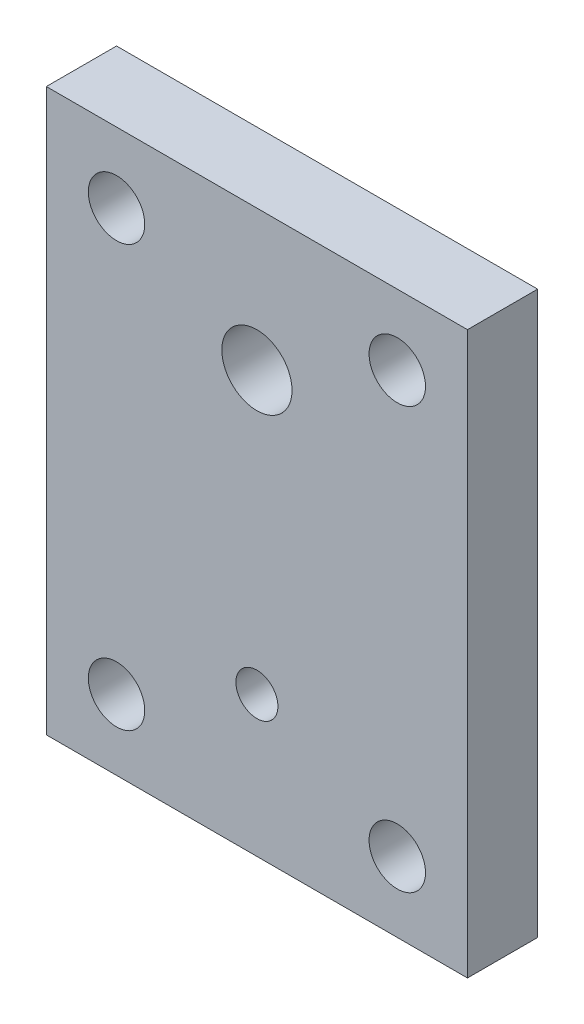
ISO-10303-21;
HEADER;
FILE_DESCRIPTION(('STEP AP214'),'2;1');
FILE_NAME('part.step','',(''),(''),'','','');
FILE_SCHEMA(('AUTOMOTIVE_DESIGN { 1 0 10303 214 1 1 1 1 }'));
ENDSEC;
DATA;
#1=APPLICATION_CONTEXT('core data for automotive mechanical design processes');
#2=APPLICATION_PROTOCOL_DEFINITION('international standard','automotive_design',2000,#1);
#3=PRODUCT_CONTEXT('',#1,'mechanical');
#4=PRODUCT('Part','Part','',(#3));
#5=PRODUCT_RELATED_PRODUCT_CATEGORY('part','',(#4));
#6=PRODUCT_DEFINITION_FORMATION('','',#4);
#7=PRODUCT_DEFINITION_CONTEXT('part definition',#1,'design');
#8=PRODUCT_DEFINITION('design','',#6,#7);
#9=PRODUCT_DEFINITION_SHAPE('','',#8);
#10=(LENGTH_UNIT() NAMED_UNIT(*) SI_UNIT(.MILLI.,.METRE.));
#11=(NAMED_UNIT(*) PLANE_ANGLE_UNIT() SI_UNIT($,.RADIAN.));
#12=(NAMED_UNIT(*) SI_UNIT($,.STERADIAN.) SOLID_ANGLE_UNIT());
#13=UNCERTAINTY_MEASURE_WITH_UNIT(LENGTH_MEASURE(1.E-05),#10,'distance_accuracy_value','');
#14=(GEOMETRIC_REPRESENTATION_CONTEXT(3) GLOBAL_UNCERTAINTY_ASSIGNED_CONTEXT((#13)) GLOBAL_UNIT_ASSIGNED_CONTEXT((#10,
#11,#12)) REPRESENTATION_CONTEXT('',''));
#15=CARTESIAN_POINT('',(0.,0.,0.));
#16=DIRECTION('',(0.,0.,1.));
#17=DIRECTION('',(1.,0.,0.));
#18=AXIS2_PLACEMENT_3D('',#15,#16,#17);
#19=CARTESIAN_POINT('',(0.,0.,6.35));
#20=DIRECTION('',(0.,0.,-1.));
#21=DIRECTION('',(-1.,0.,0.));
#22=AXIS2_PLACEMENT_3D('',#19,#20,#21);
#23=PLANE('',#22);
#24=DIRECTION('',(0.,-1.,0.));
#25=VECTOR('',#24,1.);
#26=CARTESIAN_POINT('',(0.,0.,6.35));
#27=LINE('',#26,#25);
#28=CARTESIAN_POINT('',(0.,50.8,6.35));
#29=VERTEX_POINT('',#28);
#30=CARTESIAN_POINT('',(0.,0.,6.35));
#31=VERTEX_POINT('',#30);
#32=EDGE_CURVE('E84',#29,#31,#27,.T.);
#33=ORIENTED_EDGE('',*,*,#32,.T.);
#34=DIRECTION('',(1.,0.,0.));
#35=VECTOR('',#34,1.);
#36=CARTESIAN_POINT('',(0.,0.,6.35));
#37=LINE('',#36,#35);
#38=CARTESIAN_POINT('',(38.1,0.,6.35));
#39=VERTEX_POINT('',#38);
#40=EDGE_CURVE('E79',#31,#39,#37,.T.);
#41=ORIENTED_EDGE('',*,*,#40,.T.);
#42=DIRECTION('',(0.,1.,0.));
#43=VECTOR('',#42,1.);
#44=CARTESIAN_POINT('',(38.1,0.,6.35));
#45=LINE('',#44,#43);
#46=CARTESIAN_POINT('',(38.1,50.8,6.35));
#47=VERTEX_POINT('',#46);
#48=EDGE_CURVE('E82',#39,#47,#45,.T.);
#49=ORIENTED_EDGE('',*,*,#48,.T.);
#50=DIRECTION('',(-1.,0.,0.));
#51=VECTOR('',#50,1.);
#52=CARTESIAN_POINT('',(0.,50.8,6.35));
#53=LINE('',#52,#51);
#54=EDGE_CURVE('E49',#47,#29,#53,.T.);
#55=ORIENTED_EDGE('',*,*,#54,.T.);
#56=EDGE_LOOP('',(#33,#41,#49,#55));
#57=FACE_BOUND('',#56,.T.);
#58=CARTESIAN_POINT('',(6.35,44.45,6.35));
#59=DIRECTION('',(0.,0.,1.));
#60=DIRECTION('',(1.,0.,0.));
#61=AXIS2_PLACEMENT_3D('',#58,#59,#60);
#62=CIRCLE('',#61,2.5527);
#63=CARTESIAN_POINT('',(8.9027,44.45,6.35));
#64=VERTEX_POINT('',#63);
#65=EDGE_CURVE('E99',#64,#64,#62,.T.);
#66=ORIENTED_EDGE('',*,*,#65,.F.);
#67=EDGE_LOOP('',(#66));
#68=FACE_BOUND('',#67,.T.);
#69=CARTESIAN_POINT('',(31.75,44.45,6.35));
#70=DIRECTION('',(0.,0.,1.));
#71=DIRECTION('',(1.,0.,0.));
#72=AXIS2_PLACEMENT_3D('',#69,#70,#71);
#73=CIRCLE('',#72,2.5527);
#74=CARTESIAN_POINT('',(34.3027,44.45,6.35));
#75=VERTEX_POINT('',#74);
#76=EDGE_CURVE('E114',#75,#75,#73,.T.);
#77=ORIENTED_EDGE('',*,*,#76,.F.);
#78=EDGE_LOOP('',(#77));
#79=FACE_BOUND('',#78,.T.);
#80=CARTESIAN_POINT('',(31.75,6.35,6.35));
#81=DIRECTION('',(0.,0.,1.));
#82=DIRECTION('',(1.,0.,0.));
#83=AXIS2_PLACEMENT_3D('',#80,#81,#82);
#84=CIRCLE('',#83,2.5527);
#85=CARTESIAN_POINT('',(34.3027,6.35,6.35));
#86=VERTEX_POINT('',#85);
#87=EDGE_CURVE('E120',#86,#86,#84,.T.);
#88=ORIENTED_EDGE('',*,*,#87,.F.);
#89=EDGE_LOOP('',(#88));
#90=FACE_BOUND('',#89,.T.);
#91=CARTESIAN_POINT('',(6.35,6.35,6.35));
#92=DIRECTION('',(0.,0.,1.));
#93=DIRECTION('',(1.,0.,0.));
#94=AXIS2_PLACEMENT_3D('',#91,#92,#93);
#95=CIRCLE('',#94,2.5527);
#96=CARTESIAN_POINT('',(8.9027,6.35,6.35));
#97=VERTEX_POINT('',#96);
#98=EDGE_CURVE('E126',#97,#97,#95,.T.);
#99=ORIENTED_EDGE('',*,*,#98,.F.);
#100=EDGE_LOOP('',(#99));
#101=FACE_BOUND('',#100,.T.);
#102=CARTESIAN_POINT('',(19.05,38.1,6.35));
#103=DIRECTION('',(0.,0.,1.));
#104=DIRECTION('',(1.,0.,0.));
#105=AXIS2_PLACEMENT_3D('',#102,#103,#104);
#106=CIRCLE('',#105,3.175);
#107=CARTESIAN_POINT('',(22.225,38.1,6.35));
#108=VERTEX_POINT('',#107);
#109=EDGE_CURVE('E132',#108,#108,#106,.T.);
#110=ORIENTED_EDGE('',*,*,#109,.F.);
#111=EDGE_LOOP('',(#110));
#112=FACE_BOUND('',#111,.T.);
#113=CARTESIAN_POINT('',(19.05,12.7,6.35));
#114=DIRECTION('',(0.,0.,1.));
#115=DIRECTION('',(1.,0.,0.));
#116=AXIS2_PLACEMENT_3D('',#113,#114,#115);
#117=CIRCLE('',#116,1.89865);
#118=CARTESIAN_POINT('',(20.94865,12.7,6.35));
#119=VERTEX_POINT('',#118);
#120=EDGE_CURVE('E138',#119,#119,#117,.T.);
#121=ORIENTED_EDGE('',*,*,#120,.F.);
#122=EDGE_LOOP('',(#121));
#123=FACE_BOUND('',#122,.T.);
#124=ADVANCED_FACE('F32',(#57,#68,#79,#90,#101,#112,#123),#23,.F.);
#125=CARTESIAN_POINT('',(0.,0.,0.));
#126=DIRECTION('',(0.,0.,-1.));
#127=DIRECTION('',(-1.,0.,0.));
#128=AXIS2_PLACEMENT_3D('',#125,#126,#127);
#129=PLANE('',#128);
#130=CARTESIAN_POINT('',(19.05,38.1,0.));
#131=DIRECTION('',(0.,0.,1.));
#132=DIRECTION('',(1.,0.,0.));
#133=AXIS2_PLACEMENT_3D('',#130,#131,#132);
#134=CIRCLE('',#133,3.175);
#135=CARTESIAN_POINT('',(22.225,38.1,0.));
#136=VERTEX_POINT('',#135);
#137=EDGE_CURVE('E135',#136,#136,#134,.T.);
#138=ORIENTED_EDGE('',*,*,#137,.T.);
#139=EDGE_LOOP('',(#138));
#140=FACE_BOUND('',#139,.T.);
#141=CARTESIAN_POINT('',(31.75,6.35,0.));
#142=DIRECTION('',(0.,0.,1.));
#143=DIRECTION('',(1.,0.,0.));
#144=AXIS2_PLACEMENT_3D('',#141,#142,#143);
#145=CIRCLE('',#144,2.5527);
#146=CARTESIAN_POINT('',(34.3027,6.35,0.));
#147=VERTEX_POINT('',#146);
#148=EDGE_CURVE('E123',#147,#147,#145,.T.);
#149=ORIENTED_EDGE('',*,*,#148,.T.);
#150=EDGE_LOOP('',(#149));
#151=FACE_BOUND('',#150,.T.);
#152=CARTESIAN_POINT('',(6.35,44.45,0.));
#153=DIRECTION('',(0.,0.,1.));
#154=DIRECTION('',(1.,0.,0.));
#155=AXIS2_PLACEMENT_3D('',#152,#153,#154);
#156=CIRCLE('',#155,2.5527);
#157=CARTESIAN_POINT('',(8.9027,44.45,0.));
#158=VERTEX_POINT('',#157);
#159=EDGE_CURVE('E111',#158,#158,#156,.T.);
#160=ORIENTED_EDGE('',*,*,#159,.T.);
#161=EDGE_LOOP('',(#160));
#162=FACE_BOUND('',#161,.T.);
#163=DIRECTION('',(0.,-1.,0.));
#164=VECTOR('',#163,1.);
#165=CARTESIAN_POINT('',(0.,0.,0.));
#166=LINE('',#165,#164);
#167=CARTESIAN_POINT('',(0.,50.8,0.));
#168=VERTEX_POINT('',#167);
#169=CARTESIAN_POINT('',(0.,0.,0.));
#170=VERTEX_POINT('',#169);
#171=EDGE_CURVE('E96',#168,#170,#166,.T.);
#172=ORIENTED_EDGE('',*,*,#171,.F.);
#173=DIRECTION('',(-1.,0.,0.));
#174=VECTOR('',#173,1.);
#175=CARTESIAN_POINT('',(0.,50.8,0.));
#176=LINE('',#175,#174);
#177=CARTESIAN_POINT('',(38.1,50.8,0.));
#178=VERTEX_POINT('',#177);
#179=EDGE_CURVE('E72',#178,#168,#176,.T.);
#180=ORIENTED_EDGE('',*,*,#179,.F.);
#181=DIRECTION('',(0.,1.,0.));
#182=VECTOR('',#181,1.);
#183=CARTESIAN_POINT('',(38.1,0.,0.));
#184=LINE('',#183,#182);
#185=CARTESIAN_POINT('',(38.1,0.,0.));
#186=VERTEX_POINT('',#185);
#187=EDGE_CURVE('E66',#186,#178,#184,.T.);
#188=ORIENTED_EDGE('',*,*,#187,.F.);
#189=DIRECTION('',(1.,0.,0.));
#190=VECTOR('',#189,1.);
#191=CARTESIAN_POINT('',(0.,0.,0.));
#192=LINE('',#191,#190);
#193=EDGE_CURVE('E88',#170,#186,#192,.T.);
#194=ORIENTED_EDGE('',*,*,#193,.F.);
#195=EDGE_LOOP('',(#172,#180,#188,#194));
#196=FACE_BOUND('',#195,.T.);
#197=CARTESIAN_POINT('',(31.75,44.45,0.));
#198=DIRECTION('',(0.,0.,1.));
#199=DIRECTION('',(1.,0.,0.));
#200=AXIS2_PLACEMENT_3D('',#197,#198,#199);
#201=CIRCLE('',#200,2.5527);
#202=CARTESIAN_POINT('',(34.3027,44.45,0.));
#203=VERTEX_POINT('',#202);
#204=EDGE_CURVE('E117',#203,#203,#201,.T.);
#205=ORIENTED_EDGE('',*,*,#204,.T.);
#206=EDGE_LOOP('',(#205));
#207=FACE_BOUND('',#206,.T.);
#208=CARTESIAN_POINT('',(6.35,6.35,0.));
#209=DIRECTION('',(0.,0.,1.));
#210=DIRECTION('',(1.,0.,0.));
#211=AXIS2_PLACEMENT_3D('',#208,#209,#210);
#212=CIRCLE('',#211,2.5527);
#213=CARTESIAN_POINT('',(8.9027,6.35,0.));
#214=VERTEX_POINT('',#213);
#215=EDGE_CURVE('E129',#214,#214,#212,.T.);
#216=ORIENTED_EDGE('',*,*,#215,.T.);
#217=EDGE_LOOP('',(#216));
#218=FACE_BOUND('',#217,.T.);
#219=CARTESIAN_POINT('',(19.05,12.7,0.));
#220=DIRECTION('',(0.,0.,1.));
#221=DIRECTION('',(1.,0.,0.));
#222=AXIS2_PLACEMENT_3D('',#219,#220,#221);
#223=CIRCLE('',#222,1.89865);
#224=CARTESIAN_POINT('',(20.94865,12.7,0.));
#225=VERTEX_POINT('',#224);
#226=EDGE_CURVE('E141',#225,#225,#223,.T.);
#227=ORIENTED_EDGE('',*,*,#226,.T.);
#228=EDGE_LOOP('',(#227));
#229=FACE_BOUND('',#228,.T.);
#230=ADVANCED_FACE('F107',(#140,#151,#162,#196,#207,#218,#229),#129,.T.);
#231=CARTESIAN_POINT('',(0.,0.,6.35));
#232=DIRECTION('',(1.,0.,0.));
#233=DIRECTION('',(0.,1.,0.));
#234=AXIS2_PLACEMENT_3D('',#231,#232,#233);
#235=PLANE('',#234);
#236=ORIENTED_EDGE('',*,*,#171,.T.);
#237=DIRECTION('',(0.,0.,-1.));
#238=VECTOR('',#237,1.);
#239=CARTESIAN_POINT('',(0.,0.,6.35));
#240=LINE('',#239,#238);
#241=EDGE_CURVE('E11',#31,#170,#240,.T.);
#242=ORIENTED_EDGE('',*,*,#241,.F.);
#243=ORIENTED_EDGE('',*,*,#32,.F.);
#244=DIRECTION('',(0.,0.,-1.));
#245=VECTOR('',#244,1.);
#246=CARTESIAN_POINT('',(0.,50.8,6.35));
#247=LINE('',#246,#245);
#248=EDGE_CURVE('E92',#29,#168,#247,.T.);
#249=ORIENTED_EDGE('',*,*,#248,.T.);
#250=EDGE_LOOP('',(#236,#242,#243,#249));
#251=FACE_BOUND('',#250,.T.);
#252=ADVANCED_FACE('F34',(#251),#235,.F.);
#253=CARTESIAN_POINT('',(0.,0.,6.35));
#254=DIRECTION('',(0.,1.,0.));
#255=DIRECTION('',(0.,0.,1.));
#256=AXIS2_PLACEMENT_3D('',#253,#254,#255);
#257=PLANE('',#256);
#258=ORIENTED_EDGE('',*,*,#193,.T.);
#259=DIRECTION('',(0.,0.,-1.));
#260=VECTOR('',#259,1.);
#261=CARTESIAN_POINT('',(38.1,0.,6.35));
#262=LINE('',#261,#260);
#263=EDGE_CURVE('E41',#39,#186,#262,.T.);
#264=ORIENTED_EDGE('',*,*,#263,.F.);
#265=ORIENTED_EDGE('',*,*,#40,.F.);
#266=ORIENTED_EDGE('',*,*,#241,.T.);
#267=EDGE_LOOP('',(#258,#264,#265,#266));
#268=FACE_BOUND('',#267,.T.);
#269=ADVANCED_FACE('F87',(#268),#257,.F.);
#270=CARTESIAN_POINT('',(38.1,0.,6.35));
#271=DIRECTION('',(-1.,0.,0.));
#272=DIRECTION('',(0.,0.,1.));
#273=AXIS2_PLACEMENT_3D('',#270,#271,#272);
#274=PLANE('',#273);
#275=ORIENTED_EDGE('',*,*,#187,.T.);
#276=DIRECTION('',(0.,0.,-1.));
#277=VECTOR('',#276,1.);
#278=CARTESIAN_POINT('',(38.1,50.8,6.35));
#279=LINE('',#278,#277);
#280=EDGE_CURVE('E89',#47,#178,#279,.T.);
#281=ORIENTED_EDGE('',*,*,#280,.F.);
#282=ORIENTED_EDGE('',*,*,#48,.F.);
#283=ORIENTED_EDGE('',*,*,#263,.T.);
#284=EDGE_LOOP('',(#275,#281,#282,#283));
#285=FACE_BOUND('',#284,.T.);
#286=ADVANCED_FACE('F90',(#285),#274,.F.);
#287=CARTESIAN_POINT('',(0.,50.8,6.35));
#288=DIRECTION('',(0.,-1.,0.));
#289=DIRECTION('',(0.,0.,-1.));
#290=AXIS2_PLACEMENT_3D('',#287,#288,#289);
#291=PLANE('',#290);
#292=ORIENTED_EDGE('',*,*,#179,.T.);
#293=ORIENTED_EDGE('',*,*,#248,.F.);
#294=ORIENTED_EDGE('',*,*,#54,.F.);
#295=ORIENTED_EDGE('',*,*,#280,.T.);
#296=EDGE_LOOP('',(#292,#293,#294,#295));
#297=FACE_BOUND('',#296,.T.);
#298=ADVANCED_FACE('F104',(#297),#291,.F.);
#299=CARTESIAN_POINT('',(6.35,44.45,6.35));
#300=DIRECTION('',(0.,0.,-1.));
#301=DIRECTION('',(-1.,0.,0.));
#302=AXIS2_PLACEMENT_3D('',#299,#300,#301);
#303=CYLINDRICAL_SURFACE('',#302,2.5527);
#304=ORIENTED_EDGE('',*,*,#65,.T.);
#305=EDGE_LOOP('',(#304));
#306=FACE_BOUND('',#305,.T.);
#307=ORIENTED_EDGE('',*,*,#159,.F.);
#308=EDGE_LOOP('',(#307));
#309=FACE_BOUND('',#308,.T.);
#310=ADVANCED_FACE('F158',(#306,#309),#303,.F.);
#311=CARTESIAN_POINT('',(31.75,44.45,6.35));
#312=DIRECTION('',(0.,0.,-1.));
#313=DIRECTION('',(-1.,0.,0.));
#314=AXIS2_PLACEMENT_3D('',#311,#312,#313);
#315=CYLINDRICAL_SURFACE('',#314,2.5527);
#316=ORIENTED_EDGE('',*,*,#76,.T.);
#317=EDGE_LOOP('',(#316));
#318=FACE_BOUND('',#317,.T.);
#319=ORIENTED_EDGE('',*,*,#204,.F.);
#320=EDGE_LOOP('',(#319));
#321=FACE_BOUND('',#320,.T.);
#322=ADVANCED_FACE('F204',(#318,#321),#315,.F.);
#323=CARTESIAN_POINT('',(31.75,6.35,6.35));
#324=DIRECTION('',(0.,0.,-1.));
#325=DIRECTION('',(-1.,0.,0.));
#326=AXIS2_PLACEMENT_3D('',#323,#324,#325);
#327=CYLINDRICAL_SURFACE('',#326,2.5527);
#328=ORIENTED_EDGE('',*,*,#87,.T.);
#329=EDGE_LOOP('',(#328));
#330=FACE_BOUND('',#329,.T.);
#331=ORIENTED_EDGE('',*,*,#148,.F.);
#332=EDGE_LOOP('',(#331));
#333=FACE_BOUND('',#332,.T.);
#334=ADVANCED_FACE('F212',(#330,#333),#327,.F.);
#335=CARTESIAN_POINT('',(6.35,6.35,6.35));
#336=DIRECTION('',(0.,0.,-1.));
#337=DIRECTION('',(-1.,0.,0.));
#338=AXIS2_PLACEMENT_3D('',#335,#336,#337);
#339=CYLINDRICAL_SURFACE('',#338,2.5527);
#340=ORIENTED_EDGE('',*,*,#98,.T.);
#341=EDGE_LOOP('',(#340));
#342=FACE_BOUND('',#341,.T.);
#343=ORIENTED_EDGE('',*,*,#215,.F.);
#344=EDGE_LOOP('',(#343));
#345=FACE_BOUND('',#344,.T.);
#346=ADVANCED_FACE('F220',(#342,#345),#339,.F.);
#347=CARTESIAN_POINT('',(19.05,38.1,6.35));
#348=DIRECTION('',(0.,0.,-1.));
#349=DIRECTION('',(-1.,0.,0.));
#350=AXIS2_PLACEMENT_3D('',#347,#348,#349);
#351=CYLINDRICAL_SURFACE('',#350,3.175);
#352=ORIENTED_EDGE('',*,*,#109,.T.);
#353=EDGE_LOOP('',(#352));
#354=FACE_BOUND('',#353,.T.);
#355=ORIENTED_EDGE('',*,*,#137,.F.);
#356=EDGE_LOOP('',(#355));
#357=FACE_BOUND('',#356,.T.);
#358=ADVANCED_FACE('F229',(#354,#357),#351,.F.);
#359=CARTESIAN_POINT('',(19.05,12.7,6.35));
#360=DIRECTION('',(0.,0.,-1.));
#361=DIRECTION('',(-1.,0.,0.));
#362=AXIS2_PLACEMENT_3D('',#359,#360,#361);
#363=CYLINDRICAL_SURFACE('',#362,1.89865);
#364=ORIENTED_EDGE('',*,*,#120,.T.);
#365=EDGE_LOOP('',(#364));
#366=FACE_BOUND('',#365,.T.);
#367=ORIENTED_EDGE('',*,*,#226,.F.);
#368=EDGE_LOOP('',(#367));
#369=FACE_BOUND('',#368,.T.);
#370=ADVANCED_FACE('F147',(#366,#369),#363,.F.);
#371=CLOSED_SHELL('',(#124,#230,#252,#269,#286,#298,#310,#322,#334,#346,#358,#370));
#372=MANIFOLD_SOLID_BREP('B2',#371);
#373=ADVANCED_BREP_SHAPE_REPRESENTATION('',(#18,#372),#14);
#374=SHAPE_DEFINITION_REPRESENTATION(#9,#373);
ENDSEC;
END-ISO-10303-21;
